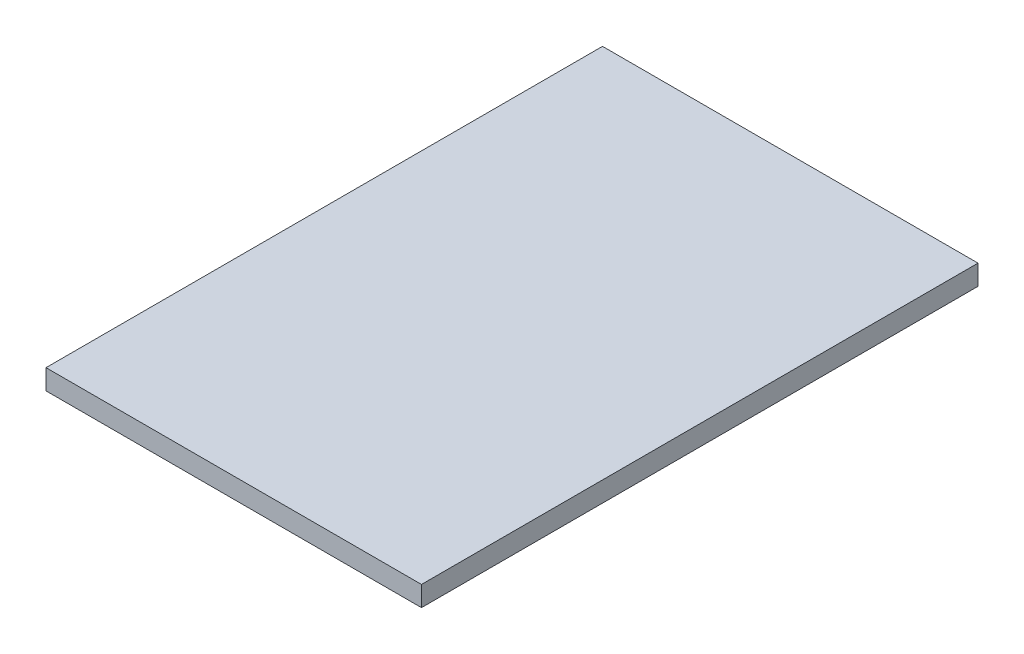
ISO-10303-21;
HEADER;
FILE_DESCRIPTION(('STEP AP214'),'2;1');
FILE_NAME('part.step','',(''),(''),'','','');
FILE_SCHEMA(('AUTOMOTIVE_DESIGN { 1 0 10303 214 1 1 1 1 }'));
ENDSEC;
DATA;
#1=APPLICATION_CONTEXT('core data for automotive mechanical design processes');
#2=APPLICATION_PROTOCOL_DEFINITION('international standard','automotive_design',2000,#1);
#3=PRODUCT_CONTEXT('',#1,'mechanical');
#4=PRODUCT('Part','Part','',(#3));
#5=PRODUCT_RELATED_PRODUCT_CATEGORY('part','',(#4));
#6=PRODUCT_DEFINITION_FORMATION('','',#4);
#7=PRODUCT_DEFINITION_CONTEXT('part definition',#1,'design');
#8=PRODUCT_DEFINITION('design','',#6,#7);
#9=PRODUCT_DEFINITION_SHAPE('','',#8);
#10=(LENGTH_UNIT() NAMED_UNIT(*) SI_UNIT(.MILLI.,.METRE.));
#11=(NAMED_UNIT(*) PLANE_ANGLE_UNIT() SI_UNIT($,.RADIAN.));
#12=(NAMED_UNIT(*) SI_UNIT($,.STERADIAN.) SOLID_ANGLE_UNIT());
#13=UNCERTAINTY_MEASURE_WITH_UNIT(LENGTH_MEASURE(1.E-05),#10,'distance_accuracy_value','');
#14=(GEOMETRIC_REPRESENTATION_CONTEXT(3) GLOBAL_UNCERTAINTY_ASSIGNED_CONTEXT((#13)) GLOBAL_UNIT_ASSIGNED_CONTEXT((#10,
#11,#12)) REPRESENTATION_CONTEXT('',''));
#15=CARTESIAN_POINT('',(0.,0.,0.));
#16=DIRECTION('',(0.,0.,1.));
#17=DIRECTION('',(1.,0.,0.));
#18=AXIS2_PLACEMENT_3D('',#15,#16,#17);
#19=CARTESIAN_POINT('',(88.9,9.525,131.7625));
#20=DIRECTION('',(-1.,0.,0.));
#21=DIRECTION('',(0.,0.,1.));
#22=AXIS2_PLACEMENT_3D('',#19,#20,#21);
#23=PLANE('',#22);
#24=DIRECTION('',(0.,0.,-1.));
#25=VECTOR('',#24,1.);
#26=CARTESIAN_POINT('',(88.9,0.,131.7625));
#27=LINE('',#26,#25);
#28=CARTESIAN_POINT('',(88.9,0.,131.7625));
#29=VERTEX_POINT('',#28);
#30=CARTESIAN_POINT('',(88.9,0.,-131.7625));
#31=VERTEX_POINT('',#30);
#32=EDGE_CURVE('E104',#29,#31,#27,.T.);
#33=ORIENTED_EDGE('',*,*,#32,.T.);
#34=DIRECTION('',(0.,-1.,0.));
#35=VECTOR('',#34,1.);
#36=CARTESIAN_POINT('',(88.9,9.525,-131.7625));
#37=LINE('',#36,#35);
#38=CARTESIAN_POINT('',(88.9,9.525,-131.7625));
#39=VERTEX_POINT('',#38);
#40=EDGE_CURVE('E11',#39,#31,#37,.T.);
#41=ORIENTED_EDGE('',*,*,#40,.F.);
#42=DIRECTION('',(0.,0.,-1.));
#43=VECTOR('',#42,1.);
#44=CARTESIAN_POINT('',(88.9,9.525,131.7625));
#45=LINE('',#44,#43);
#46=CARTESIAN_POINT('',(88.9,9.525,131.7625));
#47=VERTEX_POINT('',#46);
#48=EDGE_CURVE('E92',#47,#39,#45,.T.);
#49=ORIENTED_EDGE('',*,*,#48,.F.);
#50=DIRECTION('',(0.,-1.,0.));
#51=VECTOR('',#50,1.);
#52=CARTESIAN_POINT('',(88.9,9.525,131.7625));
#53=LINE('',#52,#51);
#54=EDGE_CURVE('E100',#47,#29,#53,.T.);
#55=ORIENTED_EDGE('',*,*,#54,.T.);
#56=EDGE_LOOP('',(#33,#41,#49,#55));
#57=FACE_BOUND('',#56,.T.);
#58=ADVANCED_FACE('F41',(#57),#23,.F.);
#59=CARTESIAN_POINT('',(-88.9,9.525,-131.7625));
#60=DIRECTION('',(0.,0.,1.));
#61=DIRECTION('',(1.,0.,0.));
#62=AXIS2_PLACEMENT_3D('',#59,#60,#61);
#63=PLANE('',#62);
#64=DIRECTION('',(-1.,0.,0.));
#65=VECTOR('',#64,1.);
#66=CARTESIAN_POINT('',(-88.9,0.,-131.7625));
#67=LINE('',#66,#65);
#68=CARTESIAN_POINT('',(-88.9,0.,-131.7625));
#69=VERTEX_POINT('',#68);
#70=EDGE_CURVE('E96',#31,#69,#67,.T.);
#71=ORIENTED_EDGE('',*,*,#70,.T.);
#72=DIRECTION('',(0.,-1.,0.));
#73=VECTOR('',#72,1.);
#74=CARTESIAN_POINT('',(-88.9,9.525,-131.7625));
#75=LINE('',#74,#73);
#76=CARTESIAN_POINT('',(-88.9,9.525,-131.7625));
#77=VERTEX_POINT('',#76);
#78=EDGE_CURVE('E49',#77,#69,#75,.T.);
#79=ORIENTED_EDGE('',*,*,#78,.F.);
#80=DIRECTION('',(-1.,0.,0.));
#81=VECTOR('',#80,1.);
#82=CARTESIAN_POINT('',(-88.9,9.525,-131.7625));
#83=LINE('',#82,#81);
#84=EDGE_CURVE('E87',#39,#77,#83,.T.);
#85=ORIENTED_EDGE('',*,*,#84,.F.);
#86=ORIENTED_EDGE('',*,*,#40,.T.);
#87=EDGE_LOOP('',(#71,#79,#85,#86));
#88=FACE_BOUND('',#87,.T.);
#89=ADVANCED_FACE('F95',(#88),#63,.F.);
#90=CARTESIAN_POINT('',(-88.9,9.525,131.7625));
#91=DIRECTION('',(1.,0.,0.));
#92=DIRECTION('',(0.,0.,-1.));
#93=AXIS2_PLACEMENT_3D('',#90,#91,#92);
#94=PLANE('',#93);
#95=DIRECTION('',(0.,0.,1.));
#96=VECTOR('',#95,1.);
#97=CARTESIAN_POINT('',(-88.9,0.,131.7625));
#98=LINE('',#97,#96);
#99=CARTESIAN_POINT('',(-88.9,0.,131.7625));
#100=VERTEX_POINT('',#99);
#101=EDGE_CURVE('E74',#69,#100,#98,.T.);
#102=ORIENTED_EDGE('',*,*,#101,.T.);
#103=DIRECTION('',(0.,-1.,0.));
#104=VECTOR('',#103,1.);
#105=CARTESIAN_POINT('',(-88.9,9.525,131.7625));
#106=LINE('',#105,#104);
#107=CARTESIAN_POINT('',(-88.9,9.525,131.7625));
#108=VERTEX_POINT('',#107);
#109=EDGE_CURVE('E97',#108,#100,#106,.T.);
#110=ORIENTED_EDGE('',*,*,#109,.F.);
#111=DIRECTION('',(0.,0.,1.));
#112=VECTOR('',#111,1.);
#113=CARTESIAN_POINT('',(-88.9,9.525,131.7625));
#114=LINE('',#113,#112);
#115=EDGE_CURVE('E90',#77,#108,#114,.T.);
#116=ORIENTED_EDGE('',*,*,#115,.F.);
#117=ORIENTED_EDGE('',*,*,#78,.T.);
#118=EDGE_LOOP('',(#102,#110,#116,#117));
#119=FACE_BOUND('',#118,.T.);
#120=ADVANCED_FACE('F98',(#119),#94,.F.);
#121=CARTESIAN_POINT('',(-88.9,9.525,131.7625));
#122=DIRECTION('',(0.,0.,-1.));
#123=DIRECTION('',(-1.,0.,0.));
#124=AXIS2_PLACEMENT_3D('',#121,#122,#123);
#125=PLANE('',#124);
#126=DIRECTION('',(1.,0.,0.));
#127=VECTOR('',#126,1.);
#128=CARTESIAN_POINT('',(-88.9,0.,131.7625));
#129=LINE('',#128,#127);
#130=EDGE_CURVE('E80',#100,#29,#129,.T.);
#131=ORIENTED_EDGE('',*,*,#130,.T.);
#132=ORIENTED_EDGE('',*,*,#54,.F.);
#133=DIRECTION('',(1.,0.,0.));
#134=VECTOR('',#133,1.);
#135=CARTESIAN_POINT('',(-88.9,9.525,131.7625));
#136=LINE('',#135,#134);
#137=EDGE_CURVE('E57',#108,#47,#136,.T.);
#138=ORIENTED_EDGE('',*,*,#137,.F.);
#139=ORIENTED_EDGE('',*,*,#109,.T.);
#140=EDGE_LOOP('',(#131,#132,#138,#139));
#141=FACE_BOUND('',#140,.T.);
#142=ADVANCED_FACE('F111',(#141),#125,.F.);
#143=CARTESIAN_POINT('',(0.,9.525,0.));
#144=DIRECTION('',(0.,-1.,0.));
#145=DIRECTION('',(0.,0.,-1.));
#146=AXIS2_PLACEMENT_3D('',#143,#144,#145);
#147=PLANE('',#146);
#148=ORIENTED_EDGE('',*,*,#48,.T.);
#149=ORIENTED_EDGE('',*,*,#84,.T.);
#150=ORIENTED_EDGE('',*,*,#115,.T.);
#151=ORIENTED_EDGE('',*,*,#137,.T.);
#152=EDGE_LOOP('',(#148,#149,#150,#151));
#153=FACE_BOUND('',#152,.T.);
#154=ADVANCED_FACE('F88',(#153),#147,.F.);
#155=CARTESIAN_POINT('',(0.,0.,0.));
#156=DIRECTION('',(0.,-1.,0.));
#157=DIRECTION('',(0.,0.,-1.));
#158=AXIS2_PLACEMENT_3D('',#155,#156,#157);
#159=PLANE('',#158);
#160=ORIENTED_EDGE('',*,*,#32,.F.);
#161=ORIENTED_EDGE('',*,*,#130,.F.);
#162=ORIENTED_EDGE('',*,*,#101,.F.);
#163=ORIENTED_EDGE('',*,*,#70,.F.);
#164=EDGE_LOOP('',(#160,#161,#162,#163));
#165=FACE_BOUND('',#164,.T.);
#166=ADVANCED_FACE('F114',(#165),#159,.T.);
#167=CLOSED_SHELL('',(#58,#89,#120,#142,#154,#166));
#168=MANIFOLD_SOLID_BREP('B2',#167);
#169=ADVANCED_BREP_SHAPE_REPRESENTATION('',(#18,#168),#14);
#170=SHAPE_DEFINITION_REPRESENTATION(#9,#169);
ENDSEC;
END-ISO-10303-21;
